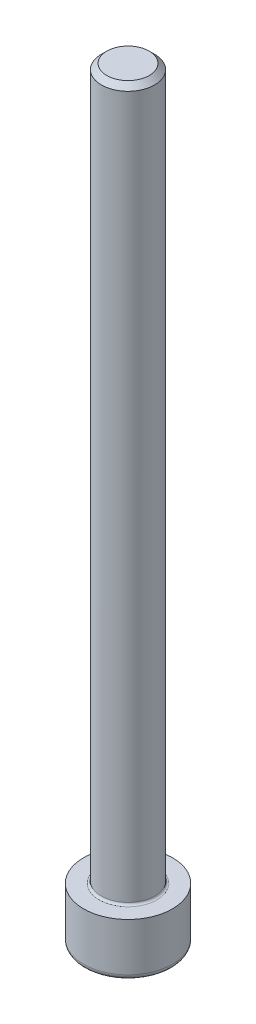
ISO-10303-21;
HEADER;
FILE_DESCRIPTION(('STEP AP214'),'2;1');
FILE_NAME('part.step','',(''),(''),'','','');
FILE_SCHEMA(('AUTOMOTIVE_DESIGN { 1 0 10303 214 1 1 1 1 }'));
ENDSEC;
DATA;
#1=APPLICATION_CONTEXT('core data for automotive mechanical design processes');
#2=APPLICATION_PROTOCOL_DEFINITION('international standard','automotive_design',2000,#1);
#3=PRODUCT_CONTEXT('',#1,'mechanical');
#4=PRODUCT('Part','Part','',(#3));
#5=PRODUCT_RELATED_PRODUCT_CATEGORY('part','',(#4));
#6=PRODUCT_DEFINITION_FORMATION('','',#4);
#7=PRODUCT_DEFINITION_CONTEXT('part definition',#1,'design');
#8=PRODUCT_DEFINITION('design','',#6,#7);
#9=PRODUCT_DEFINITION_SHAPE('','',#8);
#10=(LENGTH_UNIT() NAMED_UNIT(*) SI_UNIT(.MILLI.,.METRE.));
#11=(NAMED_UNIT(*) PLANE_ANGLE_UNIT() SI_UNIT($,.RADIAN.));
#12=(NAMED_UNIT(*) SI_UNIT($,.STERADIAN.) SOLID_ANGLE_UNIT());
#13=UNCERTAINTY_MEASURE_WITH_UNIT(LENGTH_MEASURE(1.E-05),#10,'distance_accuracy_value','');
#14=(GEOMETRIC_REPRESENTATION_CONTEXT(3) GLOBAL_UNCERTAINTY_ASSIGNED_CONTEXT((#13)) GLOBAL_UNIT_ASSIGNED_CONTEXT((#10,
#11,#12)) REPRESENTATION_CONTEXT('',''));
#15=CARTESIAN_POINT('',(0.,0.,0.));
#16=DIRECTION('',(0.,0.,1.));
#17=DIRECTION('',(1.,0.,0.));
#18=AXIS2_PLACEMENT_3D('',#15,#16,#17);
#19=CARTESIAN_POINT('',(0.,-6.,0.));
#20=DIRECTION('',(0.,-1.,0.));
#21=DIRECTION('',(1.,0.,0.));
#22=AXIS2_PLACEMENT_3D('',#19,#20,#21);
#23=PLANE('',#22);
#24=CARTESIAN_POINT('',(0.,-6.,0.));
#25=DIRECTION('',(0.,-1.,0.));
#26=DIRECTION('',(1.,0.,0.));
#27=AXIS2_PLACEMENT_3D('',#24,#25,#26);
#28=CIRCLE('',#27,4.4);
#29=CARTESIAN_POINT('',(4.4,-6.,0.));
#30=VERTEX_POINT('',#29);
#31=EDGE_CURVE('E25',#30,#30,#28,.T.);
#32=ORIENTED_EDGE('',*,*,#31,.T.);
#33=EDGE_LOOP('',(#32));
#34=FACE_BOUND('',#33,.T.);
#35=DIRECTION('',(-1.,0.,0.));
#36=VECTOR('',#35,1.);
#37=CARTESIAN_POINT('',(0.36084391825,-6.,-2.5));
#38=LINE('',#37,#36);
#39=CARTESIAN_POINT('',(1.443375673,-6.,-2.5));
#40=VERTEX_POINT('',#39);
#41=CARTESIAN_POINT('',(-1.443375673,-6.,-2.5));
#42=VERTEX_POINT('',#41);
#43=EDGE_CURVE('E109',#40,#42,#38,.T.);
#44=ORIENTED_EDGE('',*,*,#43,.T.);
#45=DIRECTION('',(-0.499999999980758,0.,0.866025403795548));
#46=VECTOR('',#45,1.);
#47=CARTESIAN_POINT('',(-2.16506350946527,-6.,-1.24999999997354));
#48=LINE('',#47,#46);
#49=CARTESIAN_POINT('',(-2.8867513459,-6.,0.));
#50=VERTEX_POINT('',#49);
#51=EDGE_CURVE('E131',#42,#50,#48,.T.);
#52=ORIENTED_EDGE('',*,*,#51,.T.);
#53=DIRECTION('',(0.499999999980757,0.,0.866025403795548));
#54=VECTOR('',#53,1.);
#55=CARTESIAN_POINT('',(-2.16506350946527,-6.,1.24999999997354));
#56=LINE('',#55,#54);
#57=CARTESIAN_POINT('',(-1.443375673,-6.,2.5));
#58=VERTEX_POINT('',#57);
#59=EDGE_CURVE('E137',#50,#58,#56,.T.);
#60=ORIENTED_EDGE('',*,*,#59,.T.);
#61=DIRECTION('',(1.,0.,0.));
#62=VECTOR('',#61,1.);
#63=CARTESIAN_POINT('',(0.,-6.,2.5));
#64=LINE('',#63,#62);
#65=CARTESIAN_POINT('',(1.443375673,-6.,2.5));
#66=VERTEX_POINT('',#65);
#67=EDGE_CURVE('E116',#58,#66,#64,.T.);
#68=ORIENTED_EDGE('',*,*,#67,.T.);
#69=DIRECTION('',(0.499999999980758,0.,-0.866025403795548));
#70=VECTOR('',#69,1.);
#71=CARTESIAN_POINT('',(2.16506350946527,-6.,1.24999999997354));
#72=LINE('',#71,#70);
#73=CARTESIAN_POINT('',(2.8867513459,-6.,0.));
#74=VERTEX_POINT('',#73);
#75=EDGE_CURVE('E111',#66,#74,#72,.T.);
#76=ORIENTED_EDGE('',*,*,#75,.T.);
#77=DIRECTION('',(-0.499999999980757,0.,-0.866025403795548));
#78=VECTOR('',#77,1.);
#79=CARTESIAN_POINT('',(2.16506350946527,-6.,-1.24999999997354));
#80=LINE('',#79,#78);
#81=EDGE_CURVE('E61',#74,#40,#80,.T.);
#82=ORIENTED_EDGE('',*,*,#81,.T.);
#83=EDGE_LOOP('',(#44,#52,#60,#68,#76,#82));
#84=FACE_BOUND('',#83,.T.);
#85=ADVANCED_FACE('F15',(#34,#84),#23,.T.);
#86=CARTESIAN_POINT('',(0.,0.,0.));
#87=DIRECTION('',(0.,1.,0.));
#88=DIRECTION('',(-1.,0.,0.));
#89=AXIS2_PLACEMENT_3D('',#86,#87,#88);
#90=PLANE('',#89);
#91=CARTESIAN_POINT('',(0.,0.,0.));
#92=DIRECTION('',(0.,1.,0.));
#93=DIRECTION('',(1.,0.,0.));
#94=AXIS2_PLACEMENT_3D('',#91,#92,#93);
#95=CIRCLE('',#94,5.);
#96=CARTESIAN_POINT('',(5.,0.,0.));
#97=VERTEX_POINT('',#96);
#98=EDGE_CURVE('E10',#97,#97,#95,.T.);
#99=ORIENTED_EDGE('',*,*,#98,.T.);
#100=EDGE_LOOP('',(#99));
#101=FACE_BOUND('',#100,.T.);
#102=CARTESIAN_POINT('',(0.,0.,0.));
#103=DIRECTION('',(0.,-1.,0.));
#104=DIRECTION('',(1.,0.,0.));
#105=AXIS2_PLACEMENT_3D('',#102,#103,#104);
#106=CIRCLE('',#105,3.25);
#107=CARTESIAN_POINT('',(3.25,0.,0.));
#108=VERTEX_POINT('',#107);
#109=EDGE_CURVE('E97',#108,#108,#106,.T.);
#110=ORIENTED_EDGE('',*,*,#109,.T.);
#111=EDGE_LOOP('',(#110));
#112=FACE_BOUND('',#111,.T.);
#113=ADVANCED_FACE('F181',(#101,#112),#90,.T.);
#114=CARTESIAN_POINT('',(0.,-3.,0.));
#115=DIRECTION('',(0.,1.,0.));
#116=DIRECTION('',(1.,0.,0.));
#117=AXIS2_PLACEMENT_3D('',#114,#115,#116);
#118=CYLINDRICAL_SURFACE('',#117,5.);
#119=ORIENTED_EDGE('',*,*,#98,.F.);
#120=EDGE_LOOP('',(#119));
#121=FACE_BOUND('',#120,.T.);
#122=CARTESIAN_POINT('',(0.,-5.4,0.));
#123=DIRECTION('',(0.,1.,0.));
#124=DIRECTION('',(1.,0.,0.));
#125=AXIS2_PLACEMENT_3D('',#122,#123,#124);
#126=CIRCLE('',#125,5.);
#127=CARTESIAN_POINT('',(5.,-5.4,0.));
#128=VERTEX_POINT('',#127);
#129=EDGE_CURVE('E113',#128,#128,#126,.T.);
#130=ORIENTED_EDGE('',*,*,#129,.T.);
#131=EDGE_LOOP('',(#130));
#132=FACE_BOUND('',#131,.T.);
#133=ADVANCED_FACE('F187',(#121,#132),#118,.T.);
#134=CARTESIAN_POINT('',(0.,-5.4,0.));
#135=DIRECTION('',(0.,-1.,0.));
#136=DIRECTION('',(0.,0.,-1.));
#137=AXIS2_PLACEMENT_3D('',#134,#135,#136);
#138=TOROIDAL_SURFACE('',#137,4.4,0.6);
#139=ORIENTED_EDGE('',*,*,#31,.F.);
#140=EDGE_LOOP('',(#139));
#141=FACE_BOUND('',#140,.T.);
#142=ORIENTED_EDGE('',*,*,#129,.F.);
#143=EDGE_LOOP('',(#142));
#144=FACE_BOUND('',#143,.T.);
#145=ADVANCED_FACE('F176',(#141,#144),#138,.T.);
#146=CARTESIAN_POINT('',(0.,-3.,0.));
#147=DIRECTION('',(0.,1.,0.));
#148=DIRECTION('',(0.,0.,-1.));
#149=AXIS2_PLACEMENT_3D('',#146,#147,#148);
#150=PLANE('',#149);
#151=DIRECTION('',(1.,0.,0.));
#152=VECTOR('',#151,1.);
#153=CARTESIAN_POINT('',(0.,-3.,-2.5));
#154=LINE('',#153,#152);
#155=CARTESIAN_POINT('',(-1.443375673,-3.,-2.5));
#156=VERTEX_POINT('',#155);
#157=CARTESIAN_POINT('',(1.443375673,-3.,-2.5));
#158=VERTEX_POINT('',#157);
#159=EDGE_CURVE('E100',#156,#158,#154,.T.);
#160=ORIENTED_EDGE('',*,*,#159,.T.);
#161=DIRECTION('',(0.499999999980757,0.,0.866025403795548));
#162=VECTOR('',#161,1.);
#163=CARTESIAN_POINT('',(2.8867513459,-3.,0.));
#164=LINE('',#163,#162);
#165=CARTESIAN_POINT('',(2.8867513459,-3.,0.));
#166=VERTEX_POINT('',#165);
#167=EDGE_CURVE('E141',#158,#166,#164,.T.);
#168=ORIENTED_EDGE('',*,*,#167,.T.);
#169=DIRECTION('',(-0.499999999980758,0.,0.866025403795548));
#170=VECTOR('',#169,1.);
#171=CARTESIAN_POINT('',(1.443375673,-3.,2.5));
#172=LINE('',#171,#170);
#173=CARTESIAN_POINT('',(1.443375673,-3.,2.5));
#174=VERTEX_POINT('',#173);
#175=EDGE_CURVE('E52',#166,#174,#172,.T.);
#176=ORIENTED_EDGE('',*,*,#175,.T.);
#177=DIRECTION('',(-1.,0.,0.));
#178=VECTOR('',#177,1.);
#179=CARTESIAN_POINT('',(-1.443375673,-3.,2.5));
#180=LINE('',#179,#178);
#181=CARTESIAN_POINT('',(-1.443375673,-3.,2.5));
#182=VERTEX_POINT('',#181);
#183=EDGE_CURVE('E114',#174,#182,#180,.T.);
#184=ORIENTED_EDGE('',*,*,#183,.T.);
#185=DIRECTION('',(-0.499999999980757,0.,-0.866025403795548));
#186=VECTOR('',#185,1.);
#187=CARTESIAN_POINT('',(-2.8867513459,-3.,0.));
#188=LINE('',#187,#186);
#189=CARTESIAN_POINT('',(-2.8867513459,-3.,0.));
#190=VERTEX_POINT('',#189);
#191=EDGE_CURVE('E19',#182,#190,#188,.T.);
#192=ORIENTED_EDGE('',*,*,#191,.T.);
#193=DIRECTION('',(0.499999999980758,0.,-0.866025403795548));
#194=VECTOR('',#193,1.);
#195=CARTESIAN_POINT('',(-1.443375673,-3.,-2.5));
#196=LINE('',#195,#194);
#197=EDGE_CURVE('E133',#190,#156,#196,.T.);
#198=ORIENTED_EDGE('',*,*,#197,.T.);
#199=EDGE_LOOP('',(#160,#168,#176,#184,#192,#198));
#200=FACE_BOUND('',#199,.T.);
#201=ADVANCED_FACE('F156',(#200),#150,.F.);
#202=CARTESIAN_POINT('',(-2.16506350945,-6.,-1.25));
#203=DIRECTION('',(-0.866025403795548,0.,-0.499999999980758));
#204=DIRECTION('',(-0.499999999980758,0.,0.866025403795548));
#205=AXIS2_PLACEMENT_3D('',#202,#203,#204);
#206=PLANE('',#205);
#207=ORIENTED_EDGE('',*,*,#197,.F.);
#208=DIRECTION('',(0.,1.,0.));
#209=VECTOR('',#208,1.);
#210=CARTESIAN_POINT('',(-2.8867513459,-6.,0.));
#211=LINE('',#210,#209);
#212=EDGE_CURVE('E134',#50,#190,#211,.T.);
#213=ORIENTED_EDGE('',*,*,#212,.F.);
#214=ORIENTED_EDGE('',*,*,#51,.F.);
#215=DIRECTION('',(0.,1.,0.));
#216=VECTOR('',#215,1.);
#217=CARTESIAN_POINT('',(-1.443375673,-6.,-2.5));
#218=LINE('',#217,#216);
#219=EDGE_CURVE('E106',#42,#156,#218,.T.);
#220=ORIENTED_EDGE('',*,*,#219,.T.);
#221=EDGE_LOOP('',(#207,#213,#214,#220));
#222=FACE_BOUND('',#221,.T.);
#223=ADVANCED_FACE('F167',(#222),#206,.F.);
#224=CARTESIAN_POINT('',(-2.16506350945,-6.,1.25));
#225=DIRECTION('',(-0.866025403795548,0.,0.499999999980757));
#226=DIRECTION('',(0.499999999980757,0.,0.866025403795548));
#227=AXIS2_PLACEMENT_3D('',#224,#225,#226);
#228=PLANE('',#227);
#229=ORIENTED_EDGE('',*,*,#191,.F.);
#230=DIRECTION('',(0.,1.,0.));
#231=VECTOR('',#230,1.);
#232=CARTESIAN_POINT('',(-1.443375673,-6.,2.5));
#233=LINE('',#232,#231);
#234=EDGE_CURVE('E121',#58,#182,#233,.T.);
#235=ORIENTED_EDGE('',*,*,#234,.F.);
#236=ORIENTED_EDGE('',*,*,#59,.F.);
#237=ORIENTED_EDGE('',*,*,#212,.T.);
#238=EDGE_LOOP('',(#229,#235,#236,#237));
#239=FACE_BOUND('',#238,.T.);
#240=ADVANCED_FACE('F158',(#239),#228,.F.);
#241=CARTESIAN_POINT('',(0.,-6.,2.5));
#242=DIRECTION('',(0.,0.,1.));
#243=DIRECTION('',(1.,0.,0.));
#244=AXIS2_PLACEMENT_3D('',#241,#242,#243);
#245=PLANE('',#244);
#246=ORIENTED_EDGE('',*,*,#183,.F.);
#247=DIRECTION('',(0.,1.,0.));
#248=VECTOR('',#247,1.);
#249=CARTESIAN_POINT('',(1.443375673,-6.,2.5));
#250=LINE('',#249,#248);
#251=EDGE_CURVE('E117',#66,#174,#250,.T.);
#252=ORIENTED_EDGE('',*,*,#251,.F.);
#253=ORIENTED_EDGE('',*,*,#67,.F.);
#254=ORIENTED_EDGE('',*,*,#234,.T.);
#255=EDGE_LOOP('',(#246,#252,#253,#254));
#256=FACE_BOUND('',#255,.T.);
#257=ADVANCED_FACE('F162',(#256),#245,.F.);
#258=CARTESIAN_POINT('',(2.16506350945,-6.,1.25));
#259=DIRECTION('',(0.866025403795548,0.,0.499999999980758));
#260=DIRECTION('',(0.499999999980758,0.,-0.866025403795548));
#261=AXIS2_PLACEMENT_3D('',#258,#259,#260);
#262=PLANE('',#261);
#263=ORIENTED_EDGE('',*,*,#175,.F.);
#264=DIRECTION('',(0.,1.,0.));
#265=VECTOR('',#264,1.);
#266=CARTESIAN_POINT('',(2.8867513459,-6.,0.));
#267=LINE('',#266,#265);
#268=EDGE_CURVE('E112',#74,#166,#267,.T.);
#269=ORIENTED_EDGE('',*,*,#268,.F.);
#270=ORIENTED_EDGE('',*,*,#75,.F.);
#271=ORIENTED_EDGE('',*,*,#251,.T.);
#272=EDGE_LOOP('',(#263,#269,#270,#271));
#273=FACE_BOUND('',#272,.T.);
#274=ADVANCED_FACE('F163',(#273),#262,.F.);
#275=CARTESIAN_POINT('',(2.16506350945,-6.,-1.25));
#276=DIRECTION('',(0.866025403795548,0.,-0.499999999980757));
#277=DIRECTION('',(-0.499999999980757,0.,-0.866025403795548));
#278=AXIS2_PLACEMENT_3D('',#275,#276,#277);
#279=PLANE('',#278);
#280=ORIENTED_EDGE('',*,*,#167,.F.);
#281=DIRECTION('',(0.,1.,0.));
#282=VECTOR('',#281,1.);
#283=CARTESIAN_POINT('',(1.443375673,-6.,-2.5));
#284=LINE('',#283,#282);
#285=EDGE_CURVE('E144',#40,#158,#284,.T.);
#286=ORIENTED_EDGE('',*,*,#285,.F.);
#287=ORIENTED_EDGE('',*,*,#81,.F.);
#288=ORIENTED_EDGE('',*,*,#268,.T.);
#289=EDGE_LOOP('',(#280,#286,#287,#288));
#290=FACE_BOUND('',#289,.T.);
#291=ADVANCED_FACE('F17',(#290),#279,.F.);
#292=CARTESIAN_POINT('',(0.7216878365,-6.,-2.5));
#293=DIRECTION('',(0.,0.,-1.));
#294=DIRECTION('',(-1.,0.,0.));
#295=AXIS2_PLACEMENT_3D('',#292,#293,#294);
#296=PLANE('',#295);
#297=ORIENTED_EDGE('',*,*,#159,.F.);
#298=ORIENTED_EDGE('',*,*,#219,.F.);
#299=ORIENTED_EDGE('',*,*,#43,.F.);
#300=ORIENTED_EDGE('',*,*,#285,.T.);
#301=EDGE_LOOP('',(#297,#298,#299,#300));
#302=FACE_BOUND('',#301,.T.);
#303=ADVANCED_FACE('F165',(#302),#296,.F.);
#304=CARTESIAN_POINT('',(0.,0.25,0.));
#305=DIRECTION('',(0.,1.,0.));
#306=DIRECTION('',(1.,0.,0.));
#307=AXIS2_PLACEMENT_3D('',#304,#305,#306);
#308=TOROIDAL_SURFACE('',#307,3.25,0.25);
#309=ORIENTED_EDGE('',*,*,#109,.F.);
#310=EDGE_LOOP('',(#309));
#311=FACE_BOUND('',#310,.T.);
#312=CARTESIAN_POINT('',(0.,0.25,0.));
#313=DIRECTION('',(0.,1.,0.));
#314=DIRECTION('',(0.,0.,1.));
#315=AXIS2_PLACEMENT_3D('',#312,#313,#314);
#316=CIRCLE('',#315,3.);
#317=CARTESIAN_POINT('',(0.,0.25,-3.));
#318=VERTEX_POINT('',#317);
#319=EDGE_CURVE('E93',#318,#318,#316,.T.);
#320=ORIENTED_EDGE('',*,*,#319,.F.);
#321=EDGE_LOOP('',(#320));
#322=FACE_BOUND('',#321,.T.);
#323=ADVANCED_FACE('F202',(#311,#322),#308,.F.);
#324=CARTESIAN_POINT('',(0.,80.,0.));
#325=DIRECTION('',(0.,1.,0.));
#326=DIRECTION('',(1.,0.,0.));
#327=AXIS2_PLACEMENT_3D('',#324,#325,#326);
#328=PLANE('',#327);
#329=CARTESIAN_POINT('',(0.,80.,0.));
#330=DIRECTION('',(0.,1.,0.));
#331=DIRECTION('',(1.,0.,0.));
#332=AXIS2_PLACEMENT_3D('',#329,#330,#331);
#333=CIRCLE('',#332,2.38655);
#334=CARTESIAN_POINT('',(2.38655,80.,0.));
#335=VERTEX_POINT('',#334);
#336=EDGE_CURVE('E102',#335,#335,#333,.T.);
#337=ORIENTED_EDGE('',*,*,#336,.T.);
#338=EDGE_LOOP('',(#337));
#339=FACE_BOUND('',#338,.T.);
#340=ADVANCED_FACE('F195',(#339),#328,.T.);
#341=CARTESIAN_POINT('',(0.,40.,0.));
#342=DIRECTION('',(0.,-1.,0.));
#343=DIRECTION('',(1.,0.,0.));
#344=AXIS2_PLACEMENT_3D('',#341,#342,#343);
#345=CYLINDRICAL_SURFACE('',#344,3.);
#346=ORIENTED_EDGE('',*,*,#319,.T.);
#347=EDGE_LOOP('',(#346));
#348=FACE_BOUND('',#347,.T.);
#349=CARTESIAN_POINT('',(0.,79.38655,0.));
#350=DIRECTION('',(0.,-1.,0.));
#351=DIRECTION('',(1.,0.,0.));
#352=AXIS2_PLACEMENT_3D('',#349,#350,#351);
#353=CIRCLE('',#352,3.);
#354=CARTESIAN_POINT('',(3.,79.38655,0.));
#355=VERTEX_POINT('',#354);
#356=EDGE_CURVE('E98',#355,#355,#353,.T.);
#357=ORIENTED_EDGE('',*,*,#356,.T.);
#358=EDGE_LOOP('',(#357));
#359=FACE_BOUND('',#358,.T.);
#360=ADVANCED_FACE('F94',(#348,#359),#345,.T.);
#361=CARTESIAN_POINT('',(0.,79.693275,0.));
#362=DIRECTION('',(0.,-1.,0.));
#363=DIRECTION('',(1.,0.,0.));
#364=AXIS2_PLACEMENT_3D('',#361,#362,#363);
#365=CONICAL_SURFACE('',#364,2.693275,0.785398163397448);
#366=ORIENTED_EDGE('',*,*,#356,.F.);
#367=EDGE_LOOP('',(#366));
#368=FACE_BOUND('',#367,.T.);
#369=ORIENTED_EDGE('',*,*,#336,.F.);
#370=EDGE_LOOP('',(#369));
#371=FACE_BOUND('',#370,.T.);
#372=ADVANCED_FACE('F189',(#368,#371),#365,.T.);
#373=CLOSED_SHELL('',(#85,#113,#133,#145,#201,#223,#240,#257,#274,#291,#303,#323,#340,#360,#372));
#374=MANIFOLD_SOLID_BREP('B1',#373);
#375=ADVANCED_BREP_SHAPE_REPRESENTATION('',(#18,#374),#14);
#376=SHAPE_DEFINITION_REPRESENTATION(#9,#375);
ENDSEC;
END-ISO-10303-21;
